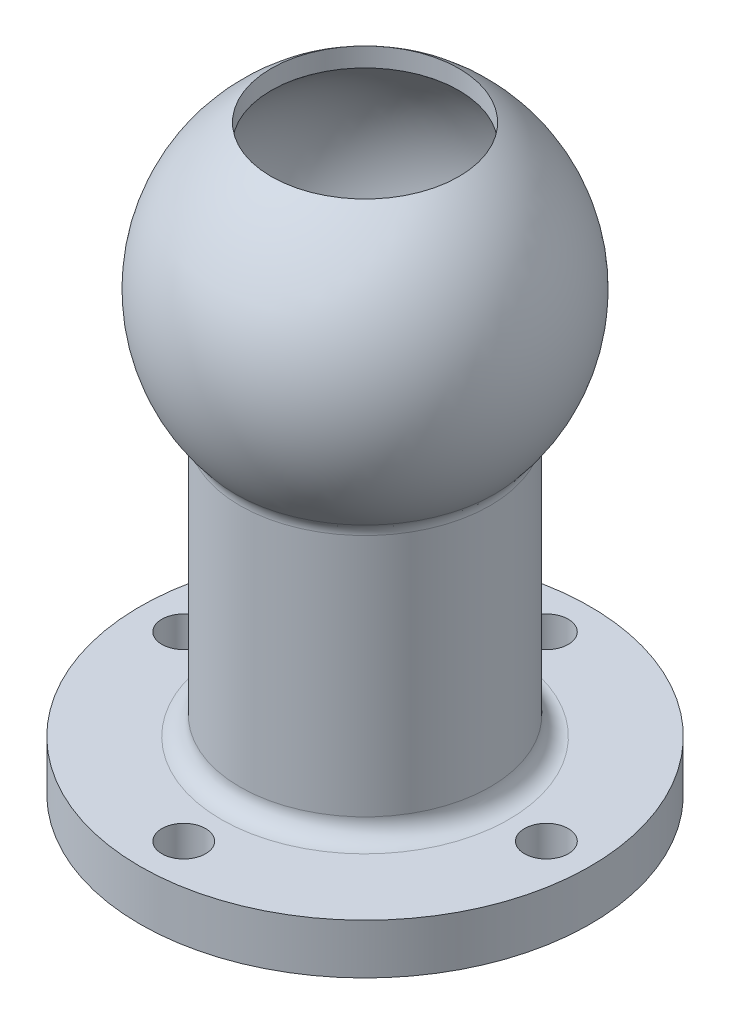
ISO-10303-21;
HEADER;
FILE_DESCRIPTION(('STEP AP214'),'2;1');
FILE_NAME('part.step','',(''),(''),'','','');
FILE_SCHEMA(('AUTOMOTIVE_DESIGN { 1 0 10303 214 1 1 1 1 }'));
ENDSEC;
DATA;
#1=APPLICATION_CONTEXT('core data for automotive mechanical design processes');
#2=APPLICATION_PROTOCOL_DEFINITION('international standard','automotive_design',2000,#1);
#3=PRODUCT_CONTEXT('',#1,'mechanical');
#4=PRODUCT('Part','Part','',(#3));
#5=PRODUCT_RELATED_PRODUCT_CATEGORY('part','',(#4));
#6=PRODUCT_DEFINITION_FORMATION('','',#4);
#7=PRODUCT_DEFINITION_CONTEXT('part definition',#1,'design');
#8=PRODUCT_DEFINITION('design','',#6,#7);
#9=PRODUCT_DEFINITION_SHAPE('','',#8);
#10=(LENGTH_UNIT() NAMED_UNIT(*) SI_UNIT(.MILLI.,.METRE.));
#11=(NAMED_UNIT(*) PLANE_ANGLE_UNIT() SI_UNIT($,.RADIAN.));
#12=(NAMED_UNIT(*) SI_UNIT($,.STERADIAN.) SOLID_ANGLE_UNIT());
#13=UNCERTAINTY_MEASURE_WITH_UNIT(LENGTH_MEASURE(1.E-05),#10,'distance_accuracy_value','');
#14=(GEOMETRIC_REPRESENTATION_CONTEXT(3) GLOBAL_UNCERTAINTY_ASSIGNED_CONTEXT((#13)) GLOBAL_UNIT_ASSIGNED_CONTEXT((#10,
#11,#12)) REPRESENTATION_CONTEXT('',''));
#15=CARTESIAN_POINT('',(0.,0.,0.));
#16=DIRECTION('',(0.,0.,1.));
#17=DIRECTION('',(1.,0.,0.));
#18=AXIS2_PLACEMENT_3D('',#15,#16,#17);
#19=CARTESIAN_POINT('',(0.,8.,0.));
#20=DIRECTION('',(0.,-1.,0.));
#21=DIRECTION('',(0.,0.,-1.));
#22=AXIS2_PLACEMENT_3D('',#19,#20,#21);
#23=CYLINDRICAL_SURFACE('',#22,36.);
#24=CARTESIAN_POINT('',(0.,8.,0.));
#25=DIRECTION('',(0.,1.,0.));
#26=DIRECTION('',(0.,0.,1.));
#27=AXIS2_PLACEMENT_3D('',#24,#25,#26);
#28=CIRCLE('',#27,36.);
#29=CARTESIAN_POINT('',(0.,8.,36.));
#30=VERTEX_POINT('',#29);
#31=EDGE_CURVE('E71',#30,#30,#28,.T.);
#32=ORIENTED_EDGE('',*,*,#31,.F.);
#33=EDGE_LOOP('',(#32));
#34=FACE_BOUND('',#33,.T.);
#35=CARTESIAN_POINT('',(0.,0.,0.));
#36=DIRECTION('',(0.,1.,0.));
#37=DIRECTION('',(0.,0.,1.));
#38=AXIS2_PLACEMENT_3D('',#35,#36,#37);
#39=CIRCLE('',#38,36.);
#40=CARTESIAN_POINT('',(0.,0.,36.));
#41=VERTEX_POINT('',#40);
#42=EDGE_CURVE('E81',#41,#41,#39,.T.);
#43=ORIENTED_EDGE('',*,*,#42,.T.);
#44=EDGE_LOOP('',(#43));
#45=FACE_BOUND('',#44,.T.);
#46=ADVANCED_FACE('F43',(#34,#45),#23,.T.);
#47=CARTESIAN_POINT('',(0.,8.,0.));
#48=DIRECTION('',(0.,1.,0.));
#49=DIRECTION('',(0.,0.,1.));
#50=AXIS2_PLACEMENT_3D('',#47,#48,#49);
#51=PLANE('',#50);
#52=CARTESIAN_POINT('',(0.,8.,0.));
#53=DIRECTION('',(0.,1.,0.));
#54=DIRECTION('',(0.,0.,1.));
#55=AXIS2_PLACEMENT_3D('',#52,#53,#54);
#56=CIRCLE('',#55,23.);
#57=CARTESIAN_POINT('',(0.,8.,23.));
#58=VERTEX_POINT('',#57);
#59=EDGE_CURVE('E10',#58,#58,#56,.F.);
#60=ORIENTED_EDGE('',*,*,#59,.T.);
#61=EDGE_LOOP('',(#60));
#62=FACE_BOUND('',#61,.T.);
#63=CARTESIAN_POINT('',(0.,8.,-29.));
#64=DIRECTION('',(0.,1.,0.));
#65=DIRECTION('',(0.,0.,1.));
#66=AXIS2_PLACEMENT_3D('',#63,#64,#65);
#67=CIRCLE('',#66,3.5);
#68=CARTESIAN_POINT('',(0.,8.,-25.5));
#69=VERTEX_POINT('',#68);
#70=EDGE_CURVE('E114',#69,#69,#67,.T.);
#71=ORIENTED_EDGE('',*,*,#70,.F.);
#72=EDGE_LOOP('',(#71));
#73=FACE_BOUND('',#72,.T.);
#74=CARTESIAN_POINT('',(29.,8.,0.));
#75=DIRECTION('',(0.,1.,0.));
#76=DIRECTION('',(0.,0.,1.));
#77=AXIS2_PLACEMENT_3D('',#74,#75,#76);
#78=CIRCLE('',#77,3.50000000000102);
#79=CARTESIAN_POINT('',(29.,8.,3.50000000000103));
#80=VERTEX_POINT('',#79);
#81=EDGE_CURVE('E110',#80,#80,#78,.T.);
#82=ORIENTED_EDGE('',*,*,#81,.F.);
#83=EDGE_LOOP('',(#82));
#84=FACE_BOUND('',#83,.T.);
#85=CARTESIAN_POINT('',(0.,8.,29.));
#86=DIRECTION('',(0.,1.,0.));
#87=DIRECTION('',(0.,0.,1.));
#88=AXIS2_PLACEMENT_3D('',#85,#86,#87);
#89=CIRCLE('',#88,3.50000000000156);
#90=CARTESIAN_POINT('',(0.,8.,32.5000000000016));
#91=VERTEX_POINT('',#90);
#92=EDGE_CURVE('E102',#91,#91,#89,.T.);
#93=ORIENTED_EDGE('',*,*,#92,.F.);
#94=EDGE_LOOP('',(#93));
#95=FACE_BOUND('',#94,.T.);
#96=CARTESIAN_POINT('',(-29.,8.,0.));
#97=DIRECTION('',(0.,1.,0.));
#98=DIRECTION('',(0.,0.,1.));
#99=AXIS2_PLACEMENT_3D('',#96,#97,#98);
#100=CIRCLE('',#99,3.50000000000054);
#101=CARTESIAN_POINT('',(-29.,8.,3.50000000000054));
#102=VERTEX_POINT('',#101);
#103=EDGE_CURVE('E93',#102,#102,#100,.T.);
#104=ORIENTED_EDGE('',*,*,#103,.F.);
#105=EDGE_LOOP('',(#104));
#106=FACE_BOUND('',#105,.T.);
#107=ORIENTED_EDGE('',*,*,#31,.T.);
#108=EDGE_LOOP('',(#107));
#109=FACE_BOUND('',#108,.T.);
#110=ADVANCED_FACE('F167',(#62,#73,#84,#95,#106,#109),#51,.T.);
#111=CARTESIAN_POINT('',(0.,0.,0.));
#112=DIRECTION('',(0.,1.,0.));
#113=DIRECTION('',(0.,0.,1.));
#114=AXIS2_PLACEMENT_3D('',#111,#112,#113);
#115=PLANE('',#114);
#116=CARTESIAN_POINT('',(0.,0.,0.));
#117=DIRECTION('',(0.,-1.,0.));
#118=DIRECTION('',(0.,0.,-1.));
#119=AXIS2_PLACEMENT_3D('',#116,#117,#118);
#120=CIRCLE('',#119,17.5);
#121=CARTESIAN_POINT('',(0.,0.,-17.5));
#122=VERTEX_POINT('',#121);
#123=EDGE_CURVE('E121',#122,#122,#120,.T.);
#124=ORIENTED_EDGE('',*,*,#123,.F.);
#125=EDGE_LOOP('',(#124));
#126=FACE_BOUND('',#125,.T.);
#127=CARTESIAN_POINT('',(0.,0.,-29.));
#128=DIRECTION('',(0.,1.,0.));
#129=DIRECTION('',(0.,0.,1.));
#130=AXIS2_PLACEMENT_3D('',#127,#128,#129);
#131=CIRCLE('',#130,3.5);
#132=CARTESIAN_POINT('',(0.,0.,-25.5));
#133=VERTEX_POINT('',#132);
#134=EDGE_CURVE('E85',#133,#133,#131,.T.);
#135=ORIENTED_EDGE('',*,*,#134,.T.);
#136=EDGE_LOOP('',(#135));
#137=FACE_BOUND('',#136,.T.);
#138=CARTESIAN_POINT('',(29.,0.,0.));
#139=DIRECTION('',(0.,1.,0.));
#140=DIRECTION('',(0.,0.,1.));
#141=AXIS2_PLACEMENT_3D('',#138,#139,#140);
#142=CIRCLE('',#141,3.50000000000102);
#143=CARTESIAN_POINT('',(29.,0.,3.50000000000103));
#144=VERTEX_POINT('',#143);
#145=EDGE_CURVE('E106',#144,#144,#142,.T.);
#146=ORIENTED_EDGE('',*,*,#145,.T.);
#147=EDGE_LOOP('',(#146));
#148=FACE_BOUND('',#147,.T.);
#149=CARTESIAN_POINT('',(0.,0.,29.));
#150=DIRECTION('',(0.,1.,0.));
#151=DIRECTION('',(0.,0.,1.));
#152=AXIS2_PLACEMENT_3D('',#149,#150,#151);
#153=CIRCLE('',#152,3.50000000000156);
#154=CARTESIAN_POINT('',(0.,0.,32.5000000000016));
#155=VERTEX_POINT('',#154);
#156=EDGE_CURVE('E98',#155,#155,#153,.T.);
#157=ORIENTED_EDGE('',*,*,#156,.T.);
#158=EDGE_LOOP('',(#157));
#159=FACE_BOUND('',#158,.T.);
#160=CARTESIAN_POINT('',(-29.,0.,0.));
#161=DIRECTION('',(0.,1.,0.));
#162=DIRECTION('',(0.,0.,1.));
#163=AXIS2_PLACEMENT_3D('',#160,#161,#162);
#164=CIRCLE('',#163,3.50000000000054);
#165=CARTESIAN_POINT('',(-29.,0.,3.50000000000054));
#166=VERTEX_POINT('',#165);
#167=EDGE_CURVE('E89',#166,#166,#164,.T.);
#168=ORIENTED_EDGE('',*,*,#167,.T.);
#169=EDGE_LOOP('',(#168));
#170=FACE_BOUND('',#169,.T.);
#171=ORIENTED_EDGE('',*,*,#42,.F.);
#172=EDGE_LOOP('',(#171));
#173=FACE_BOUND('',#172,.T.);
#174=ADVANCED_FACE('F173',(#126,#137,#148,#159,#170,#173),#115,.F.);
#175=CARTESIAN_POINT('',(-29.,0.,0.));
#176=DIRECTION('',(0.,1.,0.));
#177=DIRECTION('',(0.,0.,1.));
#178=AXIS2_PLACEMENT_3D('',#175,#176,#177);
#179=CYLINDRICAL_SURFACE('',#178,3.50000000000054);
#180=ORIENTED_EDGE('',*,*,#167,.F.);
#181=EDGE_LOOP('',(#180));
#182=FACE_BOUND('',#181,.T.);
#183=ORIENTED_EDGE('',*,*,#103,.T.);
#184=EDGE_LOOP('',(#183));
#185=FACE_BOUND('',#184,.T.);
#186=ADVANCED_FACE('F347',(#182,#185),#179,.F.);
#187=CARTESIAN_POINT('',(0.,0.,29.));
#188=DIRECTION('',(0.,1.,0.));
#189=DIRECTION('',(0.,0.,1.));
#190=AXIS2_PLACEMENT_3D('',#187,#188,#189);
#191=CYLINDRICAL_SURFACE('',#190,3.50000000000156);
#192=ORIENTED_EDGE('',*,*,#156,.F.);
#193=EDGE_LOOP('',(#192));
#194=FACE_BOUND('',#193,.T.);
#195=ORIENTED_EDGE('',*,*,#92,.T.);
#196=EDGE_LOOP('',(#195));
#197=FACE_BOUND('',#196,.T.);
#198=ADVANCED_FACE('F337',(#194,#197),#191,.F.);
#199=CARTESIAN_POINT('',(29.,0.,0.));
#200=DIRECTION('',(0.,1.,0.));
#201=DIRECTION('',(0.,0.,1.));
#202=AXIS2_PLACEMENT_3D('',#199,#200,#201);
#203=CYLINDRICAL_SURFACE('',#202,3.50000000000102);
#204=ORIENTED_EDGE('',*,*,#145,.F.);
#205=EDGE_LOOP('',(#204));
#206=FACE_BOUND('',#205,.T.);
#207=ORIENTED_EDGE('',*,*,#81,.T.);
#208=EDGE_LOOP('',(#207));
#209=FACE_BOUND('',#208,.T.);
#210=ADVANCED_FACE('F327',(#206,#209),#203,.F.);
#211=CARTESIAN_POINT('',(0.,0.,-29.));
#212=DIRECTION('',(0.,1.,0.));
#213=DIRECTION('',(0.,0.,1.));
#214=AXIS2_PLACEMENT_3D('',#211,#212,#213);
#215=CYLINDRICAL_SURFACE('',#214,3.5);
#216=ORIENTED_EDGE('',*,*,#134,.F.);
#217=EDGE_LOOP('',(#216));
#218=FACE_BOUND('',#217,.T.);
#219=ORIENTED_EDGE('',*,*,#70,.T.);
#220=EDGE_LOOP('',(#219));
#221=FACE_BOUND('',#220,.T.);
#222=ADVANCED_FACE('F317',(#218,#221),#215,.F.);
#223=CARTESIAN_POINT('',(0.,2.,0.));
#224=DIRECTION('',(0.,-1.,0.));
#225=DIRECTION('',(0.,0.,-1.));
#226=AXIS2_PLACEMENT_3D('',#223,#224,#225);
#227=CYLINDRICAL_SURFACE('',#226,17.5);
#228=CARTESIAN_POINT('',(0.,2.,0.));
#229=DIRECTION('',(0.,-1.,0.));
#230=DIRECTION('',(0.,0.,-1.));
#231=AXIS2_PLACEMENT_3D('',#228,#229,#230);
#232=CIRCLE('',#231,17.5);
#233=CARTESIAN_POINT('',(0.,2.,-17.5));
#234=VERTEX_POINT('',#233);
#235=EDGE_CURVE('E94',#234,#234,#232,.T.);
#236=ORIENTED_EDGE('',*,*,#235,.F.);
#237=EDGE_LOOP('',(#236));
#238=FACE_BOUND('',#237,.T.);
#239=ORIENTED_EDGE('',*,*,#123,.T.);
#240=EDGE_LOOP('',(#239));
#241=FACE_BOUND('',#240,.T.);
#242=ADVANCED_FACE('F307',(#238,#241),#227,.F.);
#243=CARTESIAN_POINT('',(0.,2.,0.));
#244=DIRECTION('',(0.,-1.,0.));
#245=DIRECTION('',(0.,0.,-1.));
#246=AXIS2_PLACEMENT_3D('',#243,#244,#245);
#247=PLANE('',#246);
#248=CARTESIAN_POINT('',(0.,2.,0.));
#249=DIRECTION('',(0.,1.,0.));
#250=DIRECTION('',(0.,0.,1.));
#251=AXIS2_PLACEMENT_3D('',#248,#249,#250);
#252=CIRCLE('',#251,15.);
#253=CARTESIAN_POINT('',(0.,2.,15.));
#254=VERTEX_POINT('',#253);
#255=EDGE_CURVE('E125',#254,#254,#252,.T.);
#256=ORIENTED_EDGE('',*,*,#255,.T.);
#257=EDGE_LOOP('',(#256));
#258=FACE_BOUND('',#257,.T.);
#259=ORIENTED_EDGE('',*,*,#235,.T.);
#260=EDGE_LOOP('',(#259));
#261=FACE_BOUND('',#260,.T.);
#262=ADVANCED_FACE('F246',(#258,#261),#247,.T.);
#263=CARTESIAN_POINT('',(0.,37.,0.));
#264=DIRECTION('',(0.,1.,0.));
#265=DIRECTION('',(0.,0.,1.));
#266=AXIS2_PLACEMENT_3D('',#263,#264,#265);
#267=CYLINDRICAL_SURFACE('',#266,20.);
#268=CARTESIAN_POINT('',(0.,11.,0.));
#269=DIRECTION('',(0.,1.,0.));
#270=DIRECTION('',(0.,0.,1.));
#271=AXIS2_PLACEMENT_3D('',#268,#269,#270);
#272=CIRCLE('',#271,20.);
#273=CARTESIAN_POINT('',(0.,11.,20.));
#274=VERTEX_POINT('',#273);
#275=EDGE_CURVE('E51',#274,#274,#272,.T.);
#276=ORIENTED_EDGE('',*,*,#275,.T.);
#277=EDGE_LOOP('',(#276));
#278=FACE_BOUND('',#277,.T.);
#279=CARTESIAN_POINT('',(0.,49.9687743759899,0.));
#280=DIRECTION('',(0.,1.,0.));
#281=DIRECTION('',(0.,0.,1.));
#282=AXIS2_PLACEMENT_3D('',#279,#280,#281);
#283=CIRCLE('',#282,20.);
#284=CARTESIAN_POINT('',(0.,49.9687743759899,20.));
#285=VERTEX_POINT('',#284);
#286=EDGE_CURVE('E61',#285,#285,#283,.F.);
#287=ORIENTED_EDGE('',*,*,#286,.T.);
#288=EDGE_LOOP('',(#287));
#289=FACE_BOUND('',#288,.T.);
#290=ADVANCED_FACE('F240',(#278,#289),#267,.T.);
#291=CARTESIAN_POINT('',(0.,2.,0.));
#292=DIRECTION('',(0.,1.,0.));
#293=DIRECTION('',(0.,0.,1.));
#294=AXIS2_PLACEMENT_3D('',#291,#292,#293);
#295=CYLINDRICAL_SURFACE('',#294,15.);
#296=ORIENTED_EDGE('',*,*,#255,.F.);
#297=EDGE_LOOP('',(#296));
#298=FACE_BOUND('',#297,.T.);
#299=CARTESIAN_POINT('',(0.,37.,0.));
#300=DIRECTION('',(0.,1.,0.));
#301=DIRECTION('',(0.,0.,1.));
#302=AXIS2_PLACEMENT_3D('',#299,#300,#301);
#303=CIRCLE('',#302,15.);
#304=CARTESIAN_POINT('',(0.,37.,15.));
#305=VERTEX_POINT('',#304);
#306=EDGE_CURVE('E132',#305,#305,#303,.T.);
#307=ORIENTED_EDGE('',*,*,#306,.T.);
#308=EDGE_LOOP('',(#307));
#309=FACE_BOUND('',#308,.T.);
#310=ADVANCED_FACE('F245',(#298,#309),#295,.F.);
#311=CARTESIAN_POINT('',(0.,37.,0.));
#312=DIRECTION('',(0.,1.,0.));
#313=DIRECTION('',(0.,0.,1.));
#314=AXIS2_PLACEMENT_3D('',#311,#312,#313);
#315=PLANE('',#314);
#316=CARTESIAN_POINT('',(0.,37.,0.));
#317=DIRECTION('',(0.,-1.,0.));
#318=DIRECTION('',(0.,0.,-1.));
#319=AXIS2_PLACEMENT_3D('',#316,#317,#318);
#320=CIRCLE('',#319,12.5);
#321=CARTESIAN_POINT('',(0.,37.,-12.5));
#322=VERTEX_POINT('',#321);
#323=EDGE_CURVE('E136',#322,#322,#320,.T.);
#324=ORIENTED_EDGE('',*,*,#323,.F.);
#325=EDGE_LOOP('',(#324));
#326=FACE_BOUND('',#325,.T.);
#327=ORIENTED_EDGE('',*,*,#306,.F.);
#328=EDGE_LOOP('',(#327));
#329=FACE_BOUND('',#328,.T.);
#330=ADVANCED_FACE('F162',(#326,#329),#315,.F.);
#331=CARTESIAN_POINT('',(0.,40.,0.));
#332=DIRECTION('',(0.,-1.,0.));
#333=DIRECTION('',(0.,0.,-1.));
#334=AXIS2_PLACEMENT_3D('',#331,#332,#333);
#335=CYLINDRICAL_SURFACE('',#334,12.5);
#336=CARTESIAN_POINT('',(0.,40.,0.));
#337=DIRECTION('',(0.,-1.,0.));
#338=DIRECTION('',(0.,0.,-1.));
#339=AXIS2_PLACEMENT_3D('',#336,#337,#338);
#340=CIRCLE('',#339,12.5);
#341=CARTESIAN_POINT('',(0.,40.,-12.5));
#342=VERTEX_POINT('',#341);
#343=EDGE_CURVE('E140',#342,#342,#340,.T.);
#344=ORIENTED_EDGE('',*,*,#343,.F.);
#345=EDGE_LOOP('',(#344));
#346=FACE_BOUND('',#345,.T.);
#347=ORIENTED_EDGE('',*,*,#323,.T.);
#348=EDGE_LOOP('',(#347));
#349=FACE_BOUND('',#348,.T.);
#350=ADVANCED_FACE('F153',(#346,#349),#335,.F.);
#351=CARTESIAN_POINT('',(0.,70.,0.));
#352=DIRECTION('',(0.,1.,0.));
#353=DIRECTION('',(1.,0.,0.));
#354=AXIS2_PLACEMENT_3D('',#351,#352,#353);
#355=SPHERICAL_SURFACE('',#354,27.5);
#356=CARTESIAN_POINT('',(0.,51.9390588635975,0.));
#357=DIRECTION('',(0.,1.,0.));
#358=DIRECTION('',(0.,0.,1.));
#359=AXIS2_PLACEMENT_3D('',#356,#357,#358);
#360=CIRCLE('',#359,20.7377049180328);
#361=CARTESIAN_POINT('',(20.7377049180328,51.9390588635974,0.));
#362=VERTEX_POINT('',#361);
#363=EDGE_CURVE('E67',#362,#362,#360,.T.);
#364=CARTESIAN_POINT('',(0.,93.0488611432322,0.));
#365=DIRECTION('',(0.,-1.,0.));
#366=DIRECTION('',(0.,0.,-1.));
#367=AXIS2_PLACEMENT_3D('',#364,#365,#366);
#368=CIRCLE('',#367,15.);
#369=CARTESIAN_POINT('',(15.,93.0488611432322,0.));
#370=VERTEX_POINT('',#369);
#371=EDGE_CURVE('E76',#370,#370,#368,.F.);
#372=CARTESIAN_POINT('',(20.7377049180328,51.9390588635974,0.));
#373=CARTESIAN_POINT('',(21.0594977082165,52.3085232776518,0.));
#374=CARTESIAN_POINT('',(21.3713957612082,52.6866035960724,0.));
#375=CARTESIAN_POINT('',(21.9745580416343,53.4588798821717,0.));
#376=CARTESIAN_POINT('',(22.2658222690687,53.8530758498503,0.));
#377=CARTESIAN_POINT('',(22.8268725472067,54.6564672749908,0.));
#378=CARTESIAN_POINT('',(23.0966585979103,55.0656627324527,0.));
#379=CARTESIAN_POINT('',(23.6139853076917,55.8978818033546,0.));
#380=CARTESIAN_POINT('',(23.8615259667696,56.3209054167947,0.));
#381=CARTESIAN_POINT('',(24.3336539835546,57.179573275154,0.));
#382=CARTESIAN_POINT('',(24.5582413412618,57.6152175200733,0.));
#383=CARTESIAN_POINT('',(24.9838215376037,58.4978821848585,0.));
#384=CARTESIAN_POINT('',(25.1848143762385,58.9449026047246,0.));
#385=CARTESIAN_POINT('',(25.5626314026523,59.8490429079707,0.));
#386=CARTESIAN_POINT('',(25.7394555904314,60.3061627913508,0.));
#387=CARTESIAN_POINT('',(26.0684302942699,61.2291964009386,0.));
#388=CARTESIAN_POINT('',(26.2205808103293,61.6951101271463,0.));
#389=CARTESIAN_POINT('',(26.4997735999927,62.6344007021213,0.));
#390=CARTESIAN_POINT('',(26.6268158735968,63.1077775508886,0.));
#391=CARTESIAN_POINT('',(26.8554293266009,64.0606423302825,0.));
#392=CARTESIAN_POINT('',(26.9570005060009,64.5401302609091,0.));
#393=CARTESIAN_POINT('',(27.1343816667873,65.5038477103204,0.));
#394=CARTESIAN_POINT('',(27.2101916481737,65.9880772291052,0.));
#395=CARTESIAN_POINT('',(27.3358338876306,66.9598948180725,0.));
#396=CARTESIAN_POINT('',(27.3856661457011,67.447482888255,0.));
#397=CARTESIAN_POINT('',(27.4592106096304,68.4246249507872,0.));
#398=CARTESIAN_POINT('',(27.4829228154891,68.9141789431368,0.));
#399=CARTESIAN_POINT('',(27.5041594491615,69.8938546057618,0.));
#400=CARTESIAN_POINT('',(27.5016838769751,70.3839762760372,0.));
#401=CARTESIAN_POINT('',(27.4705520251844,71.3633874289,0.));
#402=CARTESIAN_POINT('',(27.44189574558,71.8526769114875,0.));
#403=CARTESIAN_POINT('',(27.358484325856,72.8290262002197,0.));
#404=CARTESIAN_POINT('',(27.3037291857363,73.3160860063646,0.));
#405=CARTESIAN_POINT('',(27.1682764343898,74.2865848217688,0.));
#406=CARTESIAN_POINT('',(27.0875788231628,74.7700238310281,0.));
#407=CARTESIAN_POINT('',(26.9004716148425,75.7319002737914,0.));
#408=CARTESIAN_POINT('',(26.7940620177492,76.2103377072954,0.));
#409=CARTESIAN_POINT('',(26.5558347604665,77.1608445049751,0.));
#410=CARTESIAN_POINT('',(26.4240171002771,77.632913869151,0.));
#411=CARTESIAN_POINT('',(26.1353502090528,78.569336222825,0.));
#412=CARTESIAN_POINT('',(25.9785009780179,79.0336892123232,0.));
#413=CARTESIAN_POINT('',(25.640218931503,79.9533525504801,0.));
#414=CARTESIAN_POINT('',(25.458786116023,80.4086628991389,0.));
#415=CARTESIAN_POINT('',(25.071855101677,81.3089405167098,0.));
#416=CARTESIAN_POINT('',(24.8663569028109,81.7539077856219,0.));
#417=CARTESIAN_POINT('',(24.4318820572384,82.6322283461615,0.));
#418=CARTESIAN_POINT('',(24.202905410532,83.065581637789,0.));
#419=CARTESIAN_POINT('',(23.7221276633279,83.9194365180217,0.));
#420=CARTESIAN_POINT('',(23.4703265628302,84.3399381066268,0.));
#421=CARTESIAN_POINT('',(22.9446190911996,85.1668885599847,0.));
#422=CARTESIAN_POINT('',(22.6707127200667,85.5733374247373,0.));
#423=CARTESIAN_POINT('',(22.1015770308692,86.3710215523692,0.));
#424=CARTESIAN_POINT('',(21.8063477128046,86.7622568152486,0.));
#425=CARTESIAN_POINT('',(21.1954093388696,87.5283962912292,0.));
#426=CARTESIAN_POINT('',(20.8797002829991,87.9033005043304,0.));
#427=CARTESIAN_POINT('',(20.2287041968552,88.6357071603654,0.));
#428=CARTESIAN_POINT('',(19.8934171665819,88.9932096032992,0.));
#429=CARTESIAN_POINT('',(19.2042225856371,89.6897913894587,0.));
#430=CARTESIAN_POINT('',(18.8503150349658,90.0288707326844,0.));
#431=CARTESIAN_POINT('',(18.1248908983778,90.6876387712851,0.));
#432=CARTESIAN_POINT('',(17.7533743124612,91.0073274666601,0.));
#433=CARTESIAN_POINT('',(16.9937907200662,91.6263977072243,0.));
#434=CARTESIAN_POINT('',(16.6057237135878,91.9257792524136,0.));
#435=CARTESIAN_POINT('',(15.8141569761422,92.5033928765343,0.));
#436=CARTESIAN_POINT('',(15.410657245175,92.7816249554657,0.));
#437=CARTESIAN_POINT('',(15.,93.0488611432322,0.));
#438=B_SPLINE_CURVE_WITH_KNOTS('',3,(#372,#373,#374,#375,#376,#377,#378,#379,#380,#381,#382,
#383,#384,#385,#386,#387,#388,#389,#390,#391,#392,#393,#394,#395,#396,#397,#398,#399,#400,#401,
#402,#403,#404,#405,#406,#407,#408,#409,#410,#411,#412,#413,#414,#415,#416,#417,#418,#419,#420,
#421,#422,#423,#424,#425,#426,#427,#428,#429,#430,#431,#432,#433,#434,#435,#436,#437),
.UNSPECIFIED.,.F.,.F.,(4,2,2,2,2,2,2,2,2,2,2,2,2,2,2,2,2,2,2,2,2,2,2,2,2,2,2,2,2,2,2,2,4),(0.,
1.46968382489881,2.93936764979761,4.40905147469641,5.87873529959522,7.34841912449402,
8.81810294939283,10.2877867742916,11.7574705991904,13.2271544240892,14.696838248988,
16.1665220738869,17.6362058987857,19.1058897236845,20.5755735485833,22.0452573734821,
23.5149411983809,24.9846250232797,26.4543088481785,27.9239926730773,29.3936764979761,
30.8633603228749,32.3330441477737,33.8027279726725,35.2724117975713,36.7420956224701,
38.2117794473689,39.6814632722677,41.1511470971665,42.6208309220653,44.0905147469641,
45.5601985718629,47.0298823967617),.UNSPECIFIED.);
#439=EDGE_CURVE('BSEAM151',#362,#370,#438,.T.);
#440=ORIENTED_EDGE('',*,*,#363,.T.);
#441=ORIENTED_EDGE('',*,*,#371,.F.);
#442=ORIENTED_EDGE('',*,*,#439,.T.);
#443=ORIENTED_EDGE('',*,*,#439,.F.);
#444=EDGE_LOOP('',(#440,#442,#441,#443));
#445=FACE_BOUND('',#444,.T.);
#446=ADVANCED_FACE('F151',(#445),#355,.T.);
#447=CARTESIAN_POINT('',(0.,105.,0.));
#448=DIRECTION('',(0.,-1.,0.));
#449=DIRECTION('',(0.,0.,-1.));
#450=AXIS2_PLACEMENT_3D('',#447,#448,#449);
#451=CYLINDRICAL_SURFACE('',#450,15.);
#452=ORIENTED_EDGE('',*,*,#371,.T.);
#453=EDGE_LOOP('',(#452));
#454=FACE_BOUND('',#453,.T.);
#455=CARTESIAN_POINT('',(0.,90.,0.));
#456=DIRECTION('',(0.,-1.,0.));
#457=DIRECTION('',(0.,0.,-1.));
#458=AXIS2_PLACEMENT_3D('',#455,#456,#457);
#459=CIRCLE('',#458,15.);
#460=CARTESIAN_POINT('',(15.,90.,0.));
#461=VERTEX_POINT('',#460);
#462=EDGE_CURVE('E77',#461,#461,#459,.F.);
#463=ORIENTED_EDGE('',*,*,#462,.F.);
#464=EDGE_LOOP('',(#463));
#465=FACE_BOUND('',#464,.T.);
#466=ADVANCED_FACE('F148',(#454,#465),#451,.F.);
#467=CARTESIAN_POINT('',(0.,42.9580398915498,0.));
#468=DIRECTION('',(0.,-1.,0.));
#469=DIRECTION('',(0.,0.,-1.));
#470=AXIS2_PLACEMENT_3D('',#467,#468,#469);
#471=CIRCLE('',#470,15.);
#472=CARTESIAN_POINT('',(0.,42.9580398915498,-15.));
#473=VERTEX_POINT('',#472);
#474=EDGE_CURVE('E56',#473,#473,#471,.T.);
#475=ORIENTED_EDGE('',*,*,#474,.T.);
#476=EDGE_LOOP('',(#475));
#477=FACE_BOUND('',#476,.T.);
#478=CARTESIAN_POINT('',(0.,50.,0.));
#479=DIRECTION('',(0.,1.,0.));
#480=DIRECTION('',(0.,0.,1.));
#481=AXIS2_PLACEMENT_3D('',#478,#479,#480);
#482=CIRCLE('',#481,15.);
#483=CARTESIAN_POINT('',(15.,50.,0.));
#484=VERTEX_POINT('',#483);
#485=EDGE_CURVE('E72',#484,#484,#482,.F.);
#486=ORIENTED_EDGE('',*,*,#485,.F.);
#487=EDGE_LOOP('',(#486));
#488=FACE_BOUND('',#487,.T.);
#489=ADVANCED_FACE('F160',(#477,#488),#451,.F.);
#490=CARTESIAN_POINT('',(0.,70.,0.));
#491=DIRECTION('',(0.,1.,0.));
#492=DIRECTION('',(1.,0.,0.));
#493=AXIS2_PLACEMENT_3D('',#490,#491,#492);
#494=SPHERICAL_SURFACE('',#493,25.);
#495=CARTESIAN_POINT('',(15.,50.,0.));
#496=CARTESIAN_POINT('',(15.386383877575,50.2897668414672,0.));
#497=CARTESIAN_POINT('',(15.764349304277,50.5907554612936,0.));
#498=CARTESIAN_POINT('',(16.5022218904126,51.214108940858,0.));
#499=CARTESIAN_POINT('',(16.8621290498462,51.5364738005959,0.));
#500=CARTESIAN_POINT('',(17.5626637359227,52.2015124431761,0.));
#501=CARTESIAN_POINT('',(17.9032912625656,52.5441862260183,0.));
#502=CARTESIAN_POINT('',(18.5641263057405,53.248687968109,0.));
#503=CARTESIAN_POINT('',(18.8843338222726,53.6105159273575,0.));
#504=CARTESIAN_POINT('',(19.5032526836538,54.3521121103541,0.));
#505=CARTESIAN_POINT('',(19.8019640285029,54.7318803341023,0.));
#506=CARTESIAN_POINT('',(20.3768877346254,55.5080815107381,0.));
#507=CARTESIAN_POINT('',(20.6531000958988,55.9045144636258,0.));
#508=CARTESIAN_POINT('',(21.1820982609088,56.7127139738285,0.));
#509=CARTESIAN_POINT('',(21.4348840646454,57.1244805311435,0.));
#510=CARTESIAN_POINT('',(21.9161802896365,57.9619645368338,0.));
#511=CARTESIAN_POINT('',(22.1446907108911,58.3876819852091,0.));
#512=CARTESIAN_POINT('',(22.5766688391047,59.251638239793,0.));
#513=CARTESIAN_POINT('',(22.7801365460637,59.6898770460017,0.));
#514=CARTESIAN_POINT('',(23.1613460121235,60.5774044297864,0.));
#515=CARTESIAN_POINT('',(23.3390877712243,61.0266930073624,0.));
#516=CARTESIAN_POINT('',(23.6682484928968,61.934811244719,0.));
#517=CARTESIAN_POINT('',(23.8196674554685,62.3936409044996,0.));
#518=CARTESIAN_POINT('',(24.0956741265362,63.3193005780935,0.));
#519=CARTESIAN_POINT('',(24.2202618350321,63.7861305919069,0.));
#520=CARTESIAN_POINT('',(24.4421876383544,64.7262233807251,0.));
#521=CARTESIAN_POINT('',(24.5395257331807,65.19948615573,0.));
#522=CARTESIAN_POINT('',(24.7066254525011,66.1508552731488,0.));
#523=CARTESIAN_POINT('',(24.7763870769951,66.6289616155627,0.));
#524=CARTESIAN_POINT('',(24.8880995994487,67.588412409559,0.));
#525=CARTESIAN_POINT('',(24.9300504974084,68.0697568611415,0.));
#526=CARTESIAN_POINT('',(24.9860006976841,69.0340675418159,0.));
#527=CARTESIAN_POINT('',(25.,69.517033770908,0.));
#528=CARTESIAN_POINT('',(25.,70.482966229092,0.));
#529=CARTESIAN_POINT('',(24.9860006976841,70.9659324581841,0.));
#530=CARTESIAN_POINT('',(24.9300504974084,71.9302431388586,0.));
#531=CARTESIAN_POINT('',(24.8880995994487,72.411587590441,0.));
#532=CARTESIAN_POINT('',(24.7763870769951,73.3710383844373,0.));
#533=CARTESIAN_POINT('',(24.7066254525011,73.8491447268512,0.));
#534=CARTESIAN_POINT('',(24.5395257331807,74.80051384427,0.));
#535=CARTESIAN_POINT('',(24.4421876383544,75.2737766192749,0.));
#536=CARTESIAN_POINT('',(24.2202618350321,76.2138694080932,0.));
#537=CARTESIAN_POINT('',(24.0956741265362,76.6806994219065,0.));
#538=CARTESIAN_POINT('',(23.8196674554685,77.6063590955004,0.));
#539=CARTESIAN_POINT('',(23.6682484928968,78.065188755281,0.));
#540=CARTESIAN_POINT('',(23.3390877712243,78.9733069926376,0.));
#541=CARTESIAN_POINT('',(23.1613460121235,79.4225955702136,0.));
#542=CARTESIAN_POINT('',(22.7801365460637,80.3101229539983,0.));
#543=CARTESIAN_POINT('',(22.5766688391047,80.748361760207,0.));
#544=CARTESIAN_POINT('',(22.1446907108911,81.6123180147909,0.));
#545=CARTESIAN_POINT('',(21.9161802896365,82.0380354631662,0.));
#546=CARTESIAN_POINT('',(21.4348840646454,82.8755194688565,0.));
#547=CARTESIAN_POINT('',(21.1820982609088,83.2872860261715,0.));
#548=CARTESIAN_POINT('',(20.6531000958988,84.0954855363742,0.));
#549=CARTESIAN_POINT('',(20.3768877346254,84.4919184892619,0.));
#550=CARTESIAN_POINT('',(19.8019640285029,85.2681196658977,0.));
#551=CARTESIAN_POINT('',(19.5032526836538,85.6478878896459,0.));
#552=CARTESIAN_POINT('',(18.8843338222726,86.3894840726425,0.));
#553=CARTESIAN_POINT('',(18.5641263057405,86.751312031891,0.));
#554=CARTESIAN_POINT('',(17.9032912625656,87.4558137739817,0.));
#555=CARTESIAN_POINT('',(17.5626637359227,87.798487556824,0.));
#556=CARTESIAN_POINT('',(16.8621290498462,88.4635261994041,0.));
#557=CARTESIAN_POINT('',(16.5022218904126,88.785891059142,0.));
#558=CARTESIAN_POINT('',(15.764349304277,89.4092445387064,0.));
#559=CARTESIAN_POINT('',(15.386383877575,89.7102331585329,0.));
#560=CARTESIAN_POINT('',(15.,90.,0.));
#561=B_SPLINE_CURVE_WITH_KNOTS('',3,(#495,#496,#497,#498,#499,#500,#501,#502,#503,#504,#505,
#506,#507,#508,#509,#510,#511,#512,#513,#514,#515,#516,#517,#518,#519,#520,#521,#522,#523,#524,
#525,#526,#527,#528,#529,#530,#531,#532,#533,#534,#535,#536,#537,#538,#539,#540,#541,#542,#543,
#544,#545,#546,#547,#548,#549,#550,#551,#552,#553,#554,#555,#556,#557,#558,#559,#560),
.UNSPECIFIED.,.F.,.F.,(4,2,2,2,2,2,2,2,2,2,2,2,2,2,2,2,2,2,2,2,2,2,2,2,2,2,2,2,2,2,2,2,4),(0.,
1.4486960076868,2.89739201537359,4.3460880230604,5.79478403074719,7.24348003843399,
8.69217604612079,10.1408720538076,11.5895680614944,13.0382640691812,14.486960076868,
15.9356560845548,17.3843520922416,18.8330480999284,20.2817441076152,21.730440115302,
23.1791361229888,24.6278321306756,26.0765281383623,27.5252241460491,28.9739201537359,
30.4226161614227,31.8713121691095,33.3200081767963,34.7687041844831,36.2174001921699,
37.6660961998567,39.1147922075435,40.5634882152303,42.0121842229171,43.4608802306039,
44.9095762382907,46.3582722459775),.UNSPECIFIED.);
#562=EDGE_CURVE('BSEAM182',#484,#461,#561,.T.);
#563=ORIENTED_EDGE('',*,*,#485,.T.);
#564=ORIENTED_EDGE('',*,*,#462,.T.);
#565=ORIENTED_EDGE('',*,*,#562,.T.);
#566=ORIENTED_EDGE('',*,*,#562,.F.);
#567=EDGE_LOOP('',(#563,#565,#564,#566));
#568=FACE_BOUND('',#567,.T.);
#569=ADVANCED_FACE('F182',(#568),#494,.F.);
#570=CARTESIAN_POINT('',(0.,49.9687743759899,0.));
#571=DIRECTION('',(0.,1.,0.));
#572=DIRECTION('',(0.,0.,1.));
#573=AXIS2_PLACEMENT_3D('',#570,#571,#572);
#574=TOROIDAL_SURFACE('',#573,23.,3.);
#575=ORIENTED_EDGE('',*,*,#286,.F.);
#576=EDGE_LOOP('',(#575));
#577=FACE_BOUND('',#576,.T.);
#578=ORIENTED_EDGE('',*,*,#363,.F.);
#579=EDGE_LOOP('',(#578));
#580=FACE_BOUND('',#579,.T.);
#581=ADVANCED_FACE('F179',(#577,#580),#574,.F.);
#582=CARTESIAN_POINT('',(0.,42.9580398915498,0.));
#583=DIRECTION('',(0.,-1.,0.));
#584=DIRECTION('',(0.,0.,-1.));
#585=AXIS2_PLACEMENT_3D('',#582,#583,#584);
#586=TOROIDAL_SURFACE('',#585,12.,3.);
#587=ORIENTED_EDGE('',*,*,#343,.T.);
#588=EDGE_LOOP('',(#587));
#589=FACE_BOUND('',#588,.T.);
#590=ORIENTED_EDGE('',*,*,#474,.F.);
#591=EDGE_LOOP('',(#590));
#592=FACE_BOUND('',#591,.T.);
#593=ADVANCED_FACE('F181',(#589,#592),#586,.F.);
#594=CARTESIAN_POINT('',(0.,11.,0.));
#595=DIRECTION('',(0.,1.,0.));
#596=DIRECTION('',(0.,0.,1.));
#597=AXIS2_PLACEMENT_3D('',#594,#595,#596);
#598=TOROIDAL_SURFACE('',#597,23.,3.);
#599=ORIENTED_EDGE('',*,*,#59,.F.);
#600=EDGE_LOOP('',(#599));
#601=FACE_BOUND('',#600,.T.);
#602=ORIENTED_EDGE('',*,*,#275,.F.);
#603=EDGE_LOOP('',(#602));
#604=FACE_BOUND('',#603,.T.);
#605=ADVANCED_FACE('F45',(#601,#604),#598,.F.);
#606=CLOSED_SHELL('',(#46,#110,#174,#186,#198,#210,#222,#242,#262,#290,#310,#330,#350,#446,#466,
#489,#569,#581,#593,#605));
#607=MANIFOLD_SOLID_BREP('B2',#606);
#608=ADVANCED_BREP_SHAPE_REPRESENTATION('',(#18,#607),#14);
#609=SHAPE_DEFINITION_REPRESENTATION(#9,#608);
ENDSEC;
END-ISO-10303-21;
